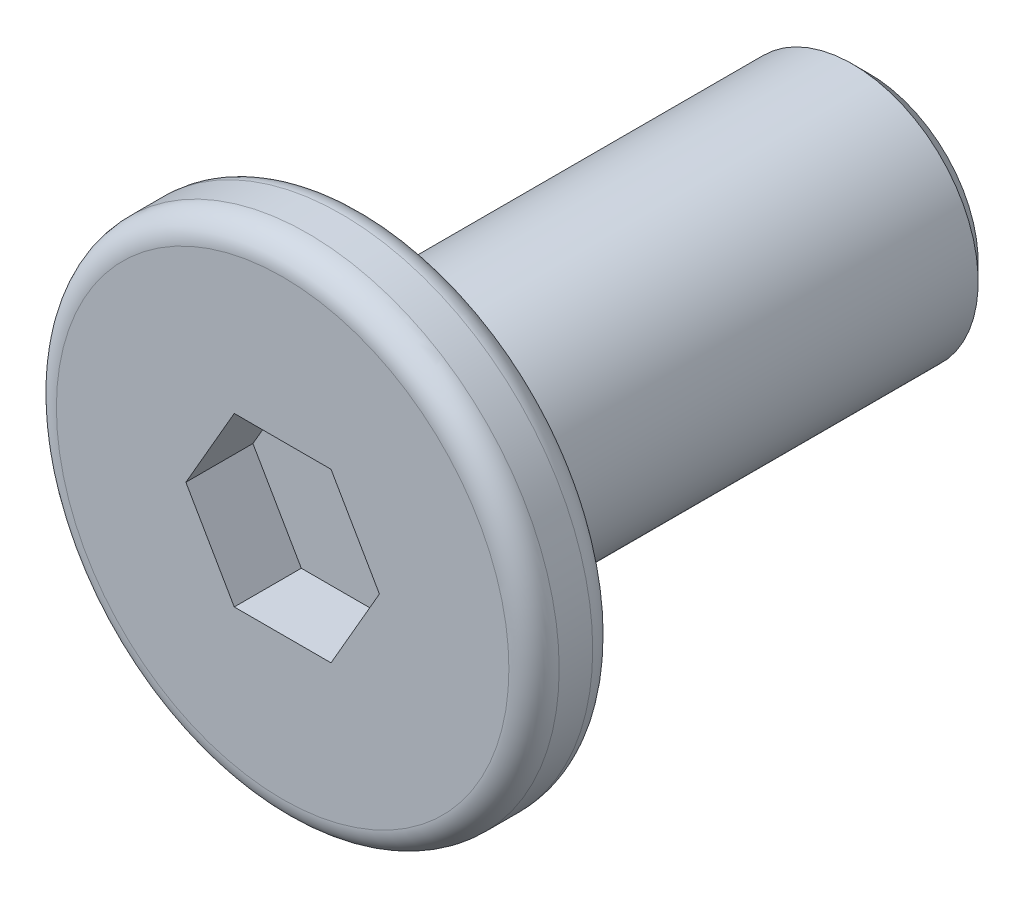
ISO-10303-21;
HEADER;
FILE_DESCRIPTION(('STEP AP214'),'2;1');
FILE_NAME('part.step','',(''),(''),'','','');
FILE_SCHEMA(('AUTOMOTIVE_DESIGN { 1 0 10303 214 1 1 1 1 }'));
ENDSEC;
DATA;
#1=APPLICATION_CONTEXT('core data for automotive mechanical design processes');
#2=APPLICATION_PROTOCOL_DEFINITION('international standard','automotive_design',2000,#1);
#3=PRODUCT_CONTEXT('',#1,'mechanical');
#4=PRODUCT('Part','Part','',(#3));
#5=PRODUCT_RELATED_PRODUCT_CATEGORY('part','',(#4));
#6=PRODUCT_DEFINITION_FORMATION('','',#4);
#7=PRODUCT_DEFINITION_CONTEXT('part definition',#1,'design');
#8=PRODUCT_DEFINITION('design','',#6,#7);
#9=PRODUCT_DEFINITION_SHAPE('','',#8);
#10=(LENGTH_UNIT() NAMED_UNIT(*) SI_UNIT(.MILLI.,.METRE.));
#11=(NAMED_UNIT(*) PLANE_ANGLE_UNIT() SI_UNIT($,.RADIAN.));
#12=(NAMED_UNIT(*) SI_UNIT($,.STERADIAN.) SOLID_ANGLE_UNIT());
#13=UNCERTAINTY_MEASURE_WITH_UNIT(LENGTH_MEASURE(1.E-05),#10,'distance_accuracy_value','');
#14=(GEOMETRIC_REPRESENTATION_CONTEXT(3) GLOBAL_UNCERTAINTY_ASSIGNED_CONTEXT((#13)) GLOBAL_UNIT_ASSIGNED_CONTEXT((#10,
#11,#12)) REPRESENTATION_CONTEXT('',''));
#15=CARTESIAN_POINT('',(0.,0.,0.));
#16=DIRECTION('',(0.,0.,1.));
#17=DIRECTION('',(1.,0.,0.));
#18=AXIS2_PLACEMENT_3D('',#15,#16,#17);
#19=CARTESIAN_POINT('',(0.,0.,0.5));
#20=DIRECTION('',(0.,0.,-1.));
#21=DIRECTION('',(-1.,0.,0.));
#22=AXIS2_PLACEMENT_3D('',#19,#20,#21);
#23=CYLINDRICAL_SURFACE('',#22,3.);
#24=CARTESIAN_POINT('',(0.,0.,-0.2));
#25=DIRECTION('',(0.,0.,1.));
#26=DIRECTION('',(1.,0.,0.));
#27=AXIS2_PLACEMENT_3D('',#24,#25,#26);
#28=CIRCLE('',#27,3.);
#29=CARTESIAN_POINT('',(3.,0.,-0.2));
#30=VERTEX_POINT('',#29);
#31=EDGE_CURVE('E154',#30,#30,#28,.T.);
#32=ORIENTED_EDGE('',*,*,#31,.T.);
#33=EDGE_LOOP('',(#32));
#34=FACE_BOUND('',#33,.T.);
#35=CARTESIAN_POINT('',(0.,0.,0.2));
#36=DIRECTION('',(0.,0.,1.));
#37=DIRECTION('',(1.,0.,0.));
#38=AXIS2_PLACEMENT_3D('',#35,#36,#37);
#39=CIRCLE('',#38,3.);
#40=CARTESIAN_POINT('',(3.,0.,0.2));
#41=VERTEX_POINT('',#40);
#42=EDGE_CURVE('E151',#41,#41,#39,.F.);
#43=ORIENTED_EDGE('',*,*,#42,.T.);
#44=EDGE_LOOP('',(#43));
#45=FACE_BOUND('',#44,.T.);
#46=ADVANCED_FACE('F35',(#34,#45),#23,.T.);
#47=CARTESIAN_POINT('',(0.,0.,0.5));
#48=DIRECTION('',(0.,0.,1.));
#49=DIRECTION('',(1.,0.,0.));
#50=AXIS2_PLACEMENT_3D('',#47,#48,#49);
#51=PLANE('',#50);
#52=CARTESIAN_POINT('',(0.,0.,0.5));
#53=DIRECTION('',(0.,0.,1.));
#54=DIRECTION('',(1.,0.,0.));
#55=AXIS2_PLACEMENT_3D('',#52,#53,#54);
#56=CIRCLE('',#55,2.7);
#57=CARTESIAN_POINT('',(2.7,0.,0.5));
#58=VERTEX_POINT('',#57);
#59=EDGE_CURVE('E11',#58,#58,#56,.T.);
#60=ORIENTED_EDGE('',*,*,#59,.T.);
#61=EDGE_LOOP('',(#60));
#62=FACE_BOUND('',#61,.T.);
#63=DIRECTION('',(0.5,0.866025403784439,0.));
#64=VECTOR('',#63,1.);
#65=CARTESIAN_POINT('',(0.577350269189626,-1.,0.5));
#66=LINE('',#65,#64);
#67=CARTESIAN_POINT('',(0.577350269189626,-1.,0.5));
#68=VERTEX_POINT('',#67);
#69=CARTESIAN_POINT('',(1.15470053837925,0.,0.5));
#70=VERTEX_POINT('',#69);
#71=EDGE_CURVE('E50',#68,#70,#66,.T.);
#72=ORIENTED_EDGE('',*,*,#71,.F.);
#73=DIRECTION('',(1.,0.,0.));
#74=VECTOR('',#73,1.);
#75=CARTESIAN_POINT('',(-0.577350269189625,-1.,0.5));
#76=LINE('',#75,#74);
#77=CARTESIAN_POINT('',(-0.577350269189625,-1.,0.5));
#78=VERTEX_POINT('',#77);
#79=EDGE_CURVE('E133',#78,#68,#76,.T.);
#80=ORIENTED_EDGE('',*,*,#79,.F.);
#81=DIRECTION('',(0.5,-0.866025403784438,0.));
#82=VECTOR('',#81,1.);
#83=CARTESIAN_POINT('',(-1.15470053837925,0.,0.5));
#84=LINE('',#83,#82);
#85=CARTESIAN_POINT('',(-1.15470053837925,0.,0.5));
#86=VERTEX_POINT('',#85);
#87=EDGE_CURVE('E131',#86,#78,#84,.T.);
#88=ORIENTED_EDGE('',*,*,#87,.F.);
#89=DIRECTION('',(-0.5,-0.866025403784438,0.));
#90=VECTOR('',#89,1.);
#91=CARTESIAN_POINT('',(-0.577350269189626,1.,0.5));
#92=LINE('',#91,#90);
#93=CARTESIAN_POINT('',(-0.577350269189626,1.,0.5));
#94=VERTEX_POINT('',#93);
#95=EDGE_CURVE('E98',#94,#86,#92,.T.);
#96=ORIENTED_EDGE('',*,*,#95,.F.);
#97=DIRECTION('',(-1.,0.,0.));
#98=VECTOR('',#97,1.);
#99=CARTESIAN_POINT('',(0.577350269189625,1.,0.5));
#100=LINE('',#99,#98);
#101=CARTESIAN_POINT('',(0.577350269189625,1.,0.5));
#102=VERTEX_POINT('',#101);
#103=EDGE_CURVE('E127',#102,#94,#100,.T.);
#104=ORIENTED_EDGE('',*,*,#103,.F.);
#105=DIRECTION('',(-0.5,0.866025403784438,0.));
#106=VECTOR('',#105,1.);
#107=CARTESIAN_POINT('',(1.15470053837925,0.,0.5));
#108=LINE('',#107,#106);
#109=EDGE_CURVE('E124',#70,#102,#108,.T.);
#110=ORIENTED_EDGE('',*,*,#109,.F.);
#111=EDGE_LOOP('',(#72,#80,#88,#96,#104,#110));
#112=FACE_BOUND('',#111,.T.);
#113=ADVANCED_FACE('F169',(#62,#112),#51,.T.);
#114=CARTESIAN_POINT('',(0.,0.,-0.5));
#115=DIRECTION('',(0.,0.,1.));
#116=DIRECTION('',(1.,0.,0.));
#117=AXIS2_PLACEMENT_3D('',#114,#115,#116);
#118=PLANE('',#117);
#119=CARTESIAN_POINT('',(0.,0.,-0.5));
#120=DIRECTION('',(0.,0.,1.));
#121=DIRECTION('',(1.,0.,0.));
#122=AXIS2_PLACEMENT_3D('',#119,#120,#121);
#123=CIRCLE('',#122,2.7);
#124=CARTESIAN_POINT('',(2.7,0.,-0.5));
#125=VERTEX_POINT('',#124);
#126=EDGE_CURVE('E43',#125,#125,#123,.F.);
#127=ORIENTED_EDGE('',*,*,#126,.T.);
#128=EDGE_LOOP('',(#127));
#129=FACE_BOUND('',#128,.T.);
#130=CARTESIAN_POINT('',(0.,0.,-0.5));
#131=DIRECTION('',(0.,0.,-1.));
#132=DIRECTION('',(-1.,0.,0.));
#133=AXIS2_PLACEMENT_3D('',#130,#131,#132);
#134=CIRCLE('',#133,1.5);
#135=CARTESIAN_POINT('',(-1.5,0.,-0.5));
#136=VERTEX_POINT('',#135);
#137=EDGE_CURVE('E137',#136,#136,#134,.T.);
#138=ORIENTED_EDGE('',*,*,#137,.F.);
#139=EDGE_LOOP('',(#138));
#140=FACE_BOUND('',#139,.T.);
#141=ADVANCED_FACE('F159',(#129,#140),#118,.F.);
#142=CARTESIAN_POINT('',(0.,0.,-6.5));
#143=DIRECTION('',(0.,0.,1.));
#144=DIRECTION('',(1.,0.,0.));
#145=AXIS2_PLACEMENT_3D('',#142,#143,#144);
#146=CYLINDRICAL_SURFACE('',#145,1.5);
#147=CARTESIAN_POINT('',(0.,0.,-6.3));
#148=DIRECTION('',(0.,0.,-1.));
#149=DIRECTION('',(-1.,0.,0.));
#150=AXIS2_PLACEMENT_3D('',#147,#148,#149);
#151=CIRCLE('',#150,1.5);
#152=CARTESIAN_POINT('',(-1.5,0.,-6.3));
#153=VERTEX_POINT('',#152);
#154=EDGE_CURVE('E148',#153,#153,#151,.F.);
#155=ORIENTED_EDGE('',*,*,#154,.T.);
#156=EDGE_LOOP('',(#155));
#157=FACE_BOUND('',#156,.T.);
#158=ORIENTED_EDGE('',*,*,#137,.T.);
#159=EDGE_LOOP('',(#158));
#160=FACE_BOUND('',#159,.T.);
#161=ADVANCED_FACE('F204',(#157,#160),#146,.T.);
#162=CARTESIAN_POINT('',(0.,0.,-6.5));
#163=DIRECTION('',(0.,0.,-1.));
#164=DIRECTION('',(-1.,0.,0.));
#165=AXIS2_PLACEMENT_3D('',#162,#163,#164);
#166=PLANE('',#165);
#167=CARTESIAN_POINT('',(0.,0.,-6.5));
#168=DIRECTION('',(0.,0.,-1.));
#169=DIRECTION('',(-1.,0.,0.));
#170=AXIS2_PLACEMENT_3D('',#167,#168,#169);
#171=CIRCLE('',#170,1.3);
#172=CARTESIAN_POINT('',(-1.3,0.,-6.5));
#173=VERTEX_POINT('',#172);
#174=EDGE_CURVE('E145',#173,#173,#171,.T.);
#175=ORIENTED_EDGE('',*,*,#174,.T.);
#176=EDGE_LOOP('',(#175));
#177=FACE_BOUND('',#176,.T.);
#178=ADVANCED_FACE('F196',(#177),#166,.T.);
#179=CARTESIAN_POINT('',(0.,0.,-6.5));
#180=DIRECTION('',(0.,0.,1.));
#181=DIRECTION('',(1.,0.,0.));
#182=AXIS2_PLACEMENT_3D('',#179,#180,#181);
#183=CONICAL_SURFACE('',#182,1.3,0.785398163397446);
#184=ORIENTED_EDGE('',*,*,#154,.F.);
#185=EDGE_LOOP('',(#184));
#186=FACE_BOUND('',#185,.T.);
#187=ORIENTED_EDGE('',*,*,#174,.F.);
#188=EDGE_LOOP('',(#187));
#189=FACE_BOUND('',#188,.T.);
#190=ADVANCED_FACE('F189',(#186,#189),#183,.T.);
#191=CARTESIAN_POINT('',(0.577350269189626,-1.,-0.3));
#192=DIRECTION('',(0.866025403784439,-0.5,0.));
#193=DIRECTION('',(0.5,0.866025403784439,0.));
#194=AXIS2_PLACEMENT_3D('',#191,#192,#193);
#195=PLANE('',#194);
#196=ORIENTED_EDGE('',*,*,#71,.T.);
#197=DIRECTION('',(0.,0.,1.));
#198=VECTOR('',#197,1.);
#199=CARTESIAN_POINT('',(1.15470053837925,0.,-0.3));
#200=LINE('',#199,#198);
#201=CARTESIAN_POINT('',(1.15470053837925,0.,-0.3));
#202=VERTEX_POINT('',#201);
#203=EDGE_CURVE('E80',#202,#70,#200,.T.);
#204=ORIENTED_EDGE('',*,*,#203,.F.);
#205=DIRECTION('',(0.5,0.866025403784439,0.));
#206=VECTOR('',#205,1.);
#207=CARTESIAN_POINT('',(0.577350269189626,-1.,-0.3));
#208=LINE('',#207,#206);
#209=CARTESIAN_POINT('',(0.577350269189626,-1.,-0.3));
#210=VERTEX_POINT('',#209);
#211=EDGE_CURVE('E135',#210,#202,#208,.T.);
#212=ORIENTED_EDGE('',*,*,#211,.F.);
#213=DIRECTION('',(0.,0.,1.));
#214=VECTOR('',#213,1.);
#215=CARTESIAN_POINT('',(0.577350269189626,-1.,-0.3));
#216=LINE('',#215,#214);
#217=EDGE_CURVE('E58',#210,#68,#216,.T.);
#218=ORIENTED_EDGE('',*,*,#217,.T.);
#219=EDGE_LOOP('',(#196,#204,#212,#218));
#220=FACE_BOUND('',#219,.T.);
#221=ADVANCED_FACE('F186',(#220),#195,.F.);
#222=CARTESIAN_POINT('',(-0.577350269189625,-1.,-0.3));
#223=DIRECTION('',(0.,-1.,0.));
#224=DIRECTION('',(1.,0.,0.));
#225=AXIS2_PLACEMENT_3D('',#222,#223,#224);
#226=PLANE('',#225);
#227=ORIENTED_EDGE('',*,*,#79,.T.);
#228=ORIENTED_EDGE('',*,*,#217,.F.);
#229=DIRECTION('',(1.,0.,0.));
#230=VECTOR('',#229,1.);
#231=CARTESIAN_POINT('',(-0.577350269189625,-1.,-0.3));
#232=LINE('',#231,#230);
#233=CARTESIAN_POINT('',(-0.577350269189625,-1.,-0.3));
#234=VERTEX_POINT('',#233);
#235=EDGE_CURVE('E110',#234,#210,#232,.T.);
#236=ORIENTED_EDGE('',*,*,#235,.F.);
#237=DIRECTION('',(0.,0.,1.));
#238=VECTOR('',#237,1.);
#239=CARTESIAN_POINT('',(-0.577350269189625,-1.,-0.3));
#240=LINE('',#239,#238);
#241=EDGE_CURVE('E102',#234,#78,#240,.T.);
#242=ORIENTED_EDGE('',*,*,#241,.T.);
#243=EDGE_LOOP('',(#227,#228,#236,#242));
#244=FACE_BOUND('',#243,.T.);
#245=ADVANCED_FACE('F188',(#244),#226,.F.);
#246=CARTESIAN_POINT('',(-1.15470053837925,0.,-0.3));
#247=DIRECTION('',(-0.866025403784438,-0.5,0.));
#248=DIRECTION('',(0.5,-0.866025403784438,0.));
#249=AXIS2_PLACEMENT_3D('',#246,#247,#248);
#250=PLANE('',#249);
#251=ORIENTED_EDGE('',*,*,#87,.T.);
#252=ORIENTED_EDGE('',*,*,#241,.F.);
#253=DIRECTION('',(0.5,-0.866025403784438,0.));
#254=VECTOR('',#253,1.);
#255=CARTESIAN_POINT('',(-1.15470053837925,0.,-0.3));
#256=LINE('',#255,#254);
#257=CARTESIAN_POINT('',(-1.15470053837925,0.,-0.3));
#258=VERTEX_POINT('',#257);
#259=EDGE_CURVE('E106',#258,#234,#256,.T.);
#260=ORIENTED_EDGE('',*,*,#259,.F.);
#261=DIRECTION('',(0.,0.,1.));
#262=VECTOR('',#261,1.);
#263=CARTESIAN_POINT('',(-1.15470053837925,0.,-0.3));
#264=LINE('',#263,#262);
#265=EDGE_CURVE('E91',#258,#86,#264,.T.);
#266=ORIENTED_EDGE('',*,*,#265,.T.);
#267=EDGE_LOOP('',(#251,#252,#260,#266));
#268=FACE_BOUND('',#267,.T.);
#269=ADVANCED_FACE('F107',(#268),#250,.F.);
#270=CARTESIAN_POINT('',(-0.577350269189626,1.,-0.3));
#271=DIRECTION('',(-0.866025403784438,0.5,0.));
#272=DIRECTION('',(-0.5,-0.866025403784439,0.));
#273=AXIS2_PLACEMENT_3D('',#270,#271,#272);
#274=PLANE('',#273);
#275=ORIENTED_EDGE('',*,*,#95,.T.);
#276=ORIENTED_EDGE('',*,*,#265,.F.);
#277=DIRECTION('',(-0.5,-0.866025403784438,0.));
#278=VECTOR('',#277,1.);
#279=CARTESIAN_POINT('',(-0.577350269189626,1.,-0.3));
#280=LINE('',#279,#278);
#281=CARTESIAN_POINT('',(-0.577350269189626,1.,-0.3));
#282=VERTEX_POINT('',#281);
#283=EDGE_CURVE('E95',#282,#258,#280,.T.);
#284=ORIENTED_EDGE('',*,*,#283,.F.);
#285=DIRECTION('',(0.,0.,1.));
#286=VECTOR('',#285,1.);
#287=CARTESIAN_POINT('',(-0.577350269189626,1.,-0.3));
#288=LINE('',#287,#286);
#289=EDGE_CURVE('E103',#282,#94,#288,.T.);
#290=ORIENTED_EDGE('',*,*,#289,.T.);
#291=EDGE_LOOP('',(#275,#276,#284,#290));
#292=FACE_BOUND('',#291,.T.);
#293=ADVANCED_FACE('F93',(#292),#274,.F.);
#294=CARTESIAN_POINT('',(0.577350269189625,1.,-0.3));
#295=DIRECTION('',(0.,1.,0.));
#296=DIRECTION('',(0.,0.,1.));
#297=AXIS2_PLACEMENT_3D('',#294,#295,#296);
#298=PLANE('',#297);
#299=ORIENTED_EDGE('',*,*,#103,.T.);
#300=ORIENTED_EDGE('',*,*,#289,.F.);
#301=DIRECTION('',(-1.,0.,0.));
#302=VECTOR('',#301,1.);
#303=CARTESIAN_POINT('',(0.577350269189625,1.,-0.3));
#304=LINE('',#303,#302);
#305=CARTESIAN_POINT('',(0.577350269189625,1.,-0.3));
#306=VERTEX_POINT('',#305);
#307=EDGE_CURVE('E116',#306,#282,#304,.T.);
#308=ORIENTED_EDGE('',*,*,#307,.F.);
#309=DIRECTION('',(0.,0.,1.));
#310=VECTOR('',#309,1.);
#311=CARTESIAN_POINT('',(0.577350269189625,1.,-0.3));
#312=LINE('',#311,#310);
#313=EDGE_CURVE('E140',#306,#102,#312,.T.);
#314=ORIENTED_EDGE('',*,*,#313,.T.);
#315=EDGE_LOOP('',(#299,#300,#308,#314));
#316=FACE_BOUND('',#315,.T.);
#317=ADVANCED_FACE('F257',(#316),#298,.F.);
#318=CARTESIAN_POINT('',(1.15470053837925,0.,-0.3));
#319=DIRECTION('',(0.866025403784438,0.5,0.));
#320=DIRECTION('',(-0.5,0.866025403784439,0.));
#321=AXIS2_PLACEMENT_3D('',#318,#319,#320);
#322=PLANE('',#321);
#323=ORIENTED_EDGE('',*,*,#109,.T.);
#324=ORIENTED_EDGE('',*,*,#313,.F.);
#325=DIRECTION('',(-0.5,0.866025403784438,0.));
#326=VECTOR('',#325,1.);
#327=CARTESIAN_POINT('',(1.15470053837925,0.,-0.3));
#328=LINE('',#327,#326);
#329=EDGE_CURVE('E118',#202,#306,#328,.T.);
#330=ORIENTED_EDGE('',*,*,#329,.F.);
#331=ORIENTED_EDGE('',*,*,#203,.T.);
#332=EDGE_LOOP('',(#323,#324,#330,#331));
#333=FACE_BOUND('',#332,.T.);
#334=ADVANCED_FACE('F184',(#333),#322,.F.);
#335=CARTESIAN_POINT('',(0.,0.,-0.3));
#336=DIRECTION('',(0.,0.,1.));
#337=DIRECTION('',(1.,0.,0.));
#338=AXIS2_PLACEMENT_3D('',#335,#336,#337);
#339=PLANE('',#338);
#340=ORIENTED_EDGE('',*,*,#211,.T.);
#341=ORIENTED_EDGE('',*,*,#329,.T.);
#342=ORIENTED_EDGE('',*,*,#307,.T.);
#343=ORIENTED_EDGE('',*,*,#283,.T.);
#344=ORIENTED_EDGE('',*,*,#259,.T.);
#345=ORIENTED_EDGE('',*,*,#235,.T.);
#346=EDGE_LOOP('',(#340,#341,#342,#343,#344,#345));
#347=FACE_BOUND('',#346,.T.);
#348=ADVANCED_FACE('F113',(#347),#339,.T.);
#349=CARTESIAN_POINT('',(0.,0.,-0.2));
#350=DIRECTION('',(0.,0.,1.));
#351=DIRECTION('',(1.,0.,0.));
#352=AXIS2_PLACEMENT_3D('',#349,#350,#351);
#353=TOROIDAL_SURFACE('',#352,2.7,0.3);
#354=ORIENTED_EDGE('',*,*,#126,.F.);
#355=EDGE_LOOP('',(#354));
#356=FACE_BOUND('',#355,.T.);
#357=ORIENTED_EDGE('',*,*,#31,.F.);
#358=EDGE_LOOP('',(#357));
#359=FACE_BOUND('',#358,.T.);
#360=ADVANCED_FACE('F162',(#356,#359),#353,.T.);
#361=CARTESIAN_POINT('',(0.,0.,0.2));
#362=DIRECTION('',(0.,0.,1.));
#363=DIRECTION('',(1.,0.,0.));
#364=AXIS2_PLACEMENT_3D('',#361,#362,#363);
#365=TOROIDAL_SURFACE('',#364,2.7,0.3);
#366=ORIENTED_EDGE('',*,*,#42,.F.);
#367=EDGE_LOOP('',(#366));
#368=FACE_BOUND('',#367,.T.);
#369=ORIENTED_EDGE('',*,*,#59,.F.);
#370=EDGE_LOOP('',(#369));
#371=FACE_BOUND('',#370,.T.);
#372=ADVANCED_FACE('F37',(#368,#371),#365,.T.);
#373=CLOSED_SHELL('',(#46,#113,#141,#161,#178,#190,#221,#245,#269,#293,#317,#334,#348,#360,#372));
#374=MANIFOLD_SOLID_BREP('B2',#373);
#375=ADVANCED_BREP_SHAPE_REPRESENTATION('',(#18,#374),#14);
#376=SHAPE_DEFINITION_REPRESENTATION(#9,#375);
ENDSEC;
END-ISO-10303-21;
